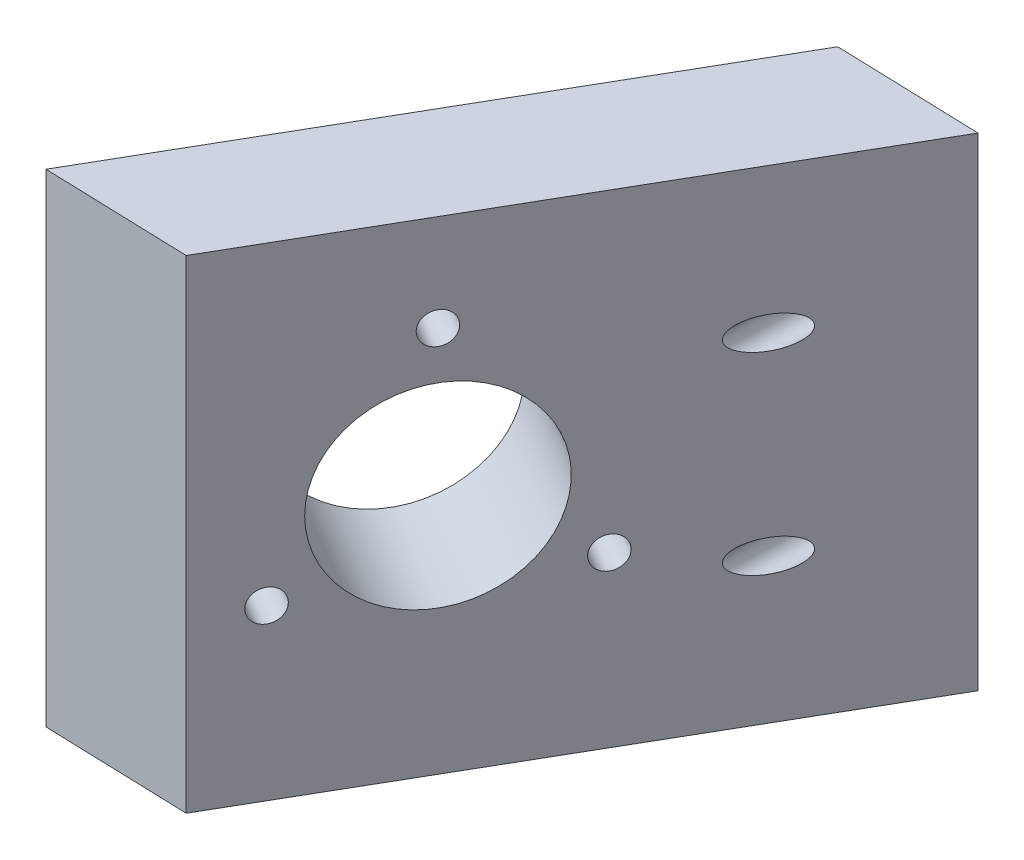
ISO-10303-21;
HEADER;
FILE_DESCRIPTION(('STEP AP214'),'2;1');
FILE_NAME('part.step','',(''),(''),'','','');
FILE_SCHEMA(('AUTOMOTIVE_DESIGN { 1 0 10303 214 1 1 1 1 }'));
ENDSEC;
DATA;
#1=APPLICATION_CONTEXT('core data for automotive mechanical design processes');
#2=APPLICATION_PROTOCOL_DEFINITION('international standard','automotive_design',2000,#1);
#3=PRODUCT_CONTEXT('',#1,'mechanical');
#4=PRODUCT('Part','Part','',(#3));
#5=PRODUCT_RELATED_PRODUCT_CATEGORY('part','',(#4));
#6=PRODUCT_DEFINITION_FORMATION('','',#4);
#7=PRODUCT_DEFINITION_CONTEXT('part definition',#1,'design');
#8=PRODUCT_DEFINITION('design','',#6,#7);
#9=PRODUCT_DEFINITION_SHAPE('','',#8);
#10=(LENGTH_UNIT() NAMED_UNIT(*) SI_UNIT(.MILLI.,.METRE.));
#11=(NAMED_UNIT(*) PLANE_ANGLE_UNIT() SI_UNIT($,.RADIAN.));
#12=(NAMED_UNIT(*) SI_UNIT($,.STERADIAN.) SOLID_ANGLE_UNIT());
#13=UNCERTAINTY_MEASURE_WITH_UNIT(LENGTH_MEASURE(1.E-05),#10,'distance_accuracy_value','');
#14=(GEOMETRIC_REPRESENTATION_CONTEXT(3) GLOBAL_UNCERTAINTY_ASSIGNED_CONTEXT((#13)) GLOBAL_UNIT_ASSIGNED_CONTEXT((#10,
#11,#12)) REPRESENTATION_CONTEXT('',''));
#15=CARTESIAN_POINT('',(0.,0.,0.));
#16=DIRECTION('',(0.,0.,1.));
#17=DIRECTION('',(1.,0.,0.));
#18=AXIS2_PLACEMENT_3D('',#15,#16,#17);
#19=CARTESIAN_POINT('',(-1.18332005275913,50.,37.2560455123764));
#20=DIRECTION('',(0.0317458177061418,0.,-0.999495974508236));
#21=DIRECTION('',(-0.999495974508236,0.,-0.0317458177061418));
#22=AXIS2_PLACEMENT_3D('',#19,#20,#21);
#23=PLANE('',#22);
#24=DIRECTION('',(0.999495974508236,0.,0.0317458177061418));
#25=VECTOR('',#24,1.);
#26=CARTESIAN_POINT('',(-1.18332005275913,0.,37.2560455123764));
#27=LINE('',#26,#25);
#28=CARTESIAN_POINT('',(-12.0885192717086,0.,36.9096764670941));
#29=VERTEX_POINT('',#28);
#30=CARTESIAN_POINT('',(2.90392034591498,0.,37.3858637326863));
#31=VERTEX_POINT('',#30);
#32=EDGE_CURVE('E137',#29,#31,#27,.T.);
#33=ORIENTED_EDGE('',*,*,#32,.T.);
#34=DIRECTION('',(0.,-1.,0.));
#35=VECTOR('',#34,1.);
#36=CARTESIAN_POINT('',(2.90392034591498,50.,37.3858637326863));
#37=LINE('',#36,#35);
#38=CARTESIAN_POINT('',(2.90392034591498,50.,37.3858637326863));
#39=VERTEX_POINT('',#38);
#40=EDGE_CURVE('E11',#39,#31,#37,.T.);
#41=ORIENTED_EDGE('',*,*,#40,.F.);
#42=DIRECTION('',(0.999495974508236,0.,0.0317458177061418));
#43=VECTOR('',#42,1.);
#44=CARTESIAN_POINT('',(-1.18332005275913,50.,37.2560455123764));
#45=LINE('',#44,#43);
#46=CARTESIAN_POINT('',(-12.0885192717086,50.,36.9096764670941));
#47=VERTEX_POINT('',#46);
#48=EDGE_CURVE('E138',#47,#39,#45,.T.);
#49=ORIENTED_EDGE('',*,*,#48,.F.);
#50=DIRECTION('',(0.,-1.,0.));
#51=VECTOR('',#50,1.);
#52=CARTESIAN_POINT('',(-12.0885192717086,50.,36.9096764670941));
#53=LINE('',#52,#51);
#54=EDGE_CURVE('E63',#47,#29,#53,.T.);
#55=ORIENTED_EDGE('',*,*,#54,.T.);
#56=EDGE_LOOP('',(#33,#41,#49,#55));
#57=FACE_BOUND('',#56,.T.);
#58=ADVANCED_FACE('F46',(#57),#23,.F.);
#59=CARTESIAN_POINT('',(18.366494126901,50.,10.603900328236));
#60=DIRECTION('',(-0.866025403784439,0.,-0.5));
#61=DIRECTION('',(-0.5,0.,0.866025403784439));
#62=AXIS2_PLACEMENT_3D('',#59,#60,#61);
#63=PLANE('',#62);
#64=CARTESIAN_POINT('',(24.9633001370909,35.,-0.822102849088624));
#65=DIRECTION('',(-0.866025403784439,0.,-0.5));
#66=DIRECTION('',(0.5,0.,-0.866025403784439));
#67=AXIS2_PLACEMENT_3D('',#64,#65,#66);
#68=ELLIPSE('',#67,3.49387289188253,1.64999999999998);
#69=CARTESIAN_POINT('',(26.7102365830322,35.,-3.84788553105269));
#70=VERTEX_POINT('',#69);
#71=EDGE_CURVE('E200',#70,#70,#68,.T.);
#72=ORIENTED_EDGE('',*,*,#71,.T.);
#73=EDGE_LOOP('',(#72));
#74=FACE_BOUND('',#73,.T.);
#75=CARTESIAN_POINT('',(24.9633001370909,15.,-0.822102849088617));
#76=DIRECTION('',(-0.866025403784439,0.,-0.5));
#77=DIRECTION('',(0.5,0.,-0.866025403784439));
#78=AXIS2_PLACEMENT_3D('',#75,#76,#77);
#79=ELLIPSE('',#78,3.49387289188253,1.64999999999999);
#80=CARTESIAN_POINT('',(26.7102365830322,15.,-3.84788553105269));
#81=VERTEX_POINT('',#80);
#82=EDGE_CURVE('E204',#81,#81,#79,.T.);
#83=ORIENTED_EDGE('',*,*,#82,.T.);
#84=EDGE_LOOP('',(#83));
#85=FACE_BOUND('',#84,.T.);
#86=CARTESIAN_POINT('',(12.44246152716,25.,20.8646257766818));
#87=DIRECTION('',(-0.866025403784439,0.,-0.5));
#88=DIRECTION('',(-0.5,0.,0.866025403784439));
#89=AXIS2_PLACEMENT_3D('',#86,#87,#88);
#90=CIRCLE('',#89,10.1);
#91=CARTESIAN_POINT('',(7.39246152716,25.,29.6114823549047));
#92=VERTEX_POINT('',#91);
#93=EDGE_CURVE('E122',#92,#92,#90,.T.);
#94=ORIENTED_EDGE('',*,*,#93,.T.);
#95=EDGE_LOOP('',(#94));
#96=FACE_BOUND('',#95,.T.);
#97=CARTESIAN_POINT('',(18.9376520555433,17.5,9.61462577668189));
#98=DIRECTION('',(0.86602540378444,0.,0.499999999999998));
#99=DIRECTION('',(0.499999999999998,0.,-0.86602540378444));
#100=AXIS2_PLACEMENT_3D('',#97,#98,#99);
#101=CIRCLE('',#100,1.64999999999999);
#102=CARTESIAN_POINT('',(19.7626520555433,17.5,8.18568386043758));
#103=VERTEX_POINT('',#102);
#104=EDGE_CURVE('E112',#103,#103,#101,.T.);
#105=ORIENTED_EDGE('',*,*,#104,.F.);
#106=EDGE_LOOP('',(#105));
#107=FACE_BOUND('',#106,.T.);
#108=CARTESIAN_POINT('',(12.44246152716,40.,20.8646257766819));
#109=DIRECTION('',(0.86602540378444,0.,0.499999999999998));
#110=DIRECTION('',(0.499999999999998,0.,-0.86602540378444));
#111=AXIS2_PLACEMENT_3D('',#108,#109,#110);
#112=CIRCLE('',#111,1.64999999999999);
#113=CARTESIAN_POINT('',(13.26746152716,40.,19.4356838604376));
#114=VERTEX_POINT('',#113);
#115=EDGE_CURVE('E111',#114,#114,#112,.T.);
#116=ORIENTED_EDGE('',*,*,#115,.F.);
#117=EDGE_LOOP('',(#116));
#118=FACE_BOUND('',#117,.T.);
#119=CARTESIAN_POINT('',(5.94727099877675,17.5,32.1146257766819));
#120=DIRECTION('',(0.86602540378444,0.,0.499999999999998));
#121=DIRECTION('',(0.499999999999998,0.,-0.86602540378444));
#122=AXIS2_PLACEMENT_3D('',#119,#120,#121);
#123=CIRCLE('',#122,1.64999999999999);
#124=CARTESIAN_POINT('',(6.77227099877674,17.5,30.6856838604376));
#125=VERTEX_POINT('',#124);
#126=EDGE_CURVE('E129',#125,#125,#123,.T.);
#127=ORIENTED_EDGE('',*,*,#126,.F.);
#128=EDGE_LOOP('',(#127));
#129=FACE_BOUND('',#128,.T.);
#130=DIRECTION('',(0.5,0.,-0.866025403784439));
#131=VECTOR('',#130,1.);
#132=CARTESIAN_POINT('',(18.366494126901,0.,10.603900328236));
#133=LINE('',#132,#131);
#134=CARTESIAN_POINT('',(32.903920345915,0.,-14.57566049438));
#135=VERTEX_POINT('',#134);
#136=EDGE_CURVE('E153',#31,#135,#133,.T.);
#137=ORIENTED_EDGE('',*,*,#136,.T.);
#138=DIRECTION('',(0.,-1.,0.));
#139=VECTOR('',#138,1.);
#140=CARTESIAN_POINT('',(32.903920345915,50.,-14.57566049438));
#141=LINE('',#140,#139);
#142=CARTESIAN_POINT('',(32.903920345915,50.,-14.57566049438));
#143=VERTEX_POINT('',#142);
#144=EDGE_CURVE('E55',#143,#135,#141,.T.);
#145=ORIENTED_EDGE('',*,*,#144,.F.);
#146=DIRECTION('',(0.5,0.,-0.866025403784439));
#147=VECTOR('',#146,1.);
#148=CARTESIAN_POINT('',(18.366494126901,50.,10.603900328236));
#149=LINE('',#148,#147);
#150=EDGE_CURVE('E89',#39,#143,#149,.T.);
#151=ORIENTED_EDGE('',*,*,#150,.F.);
#152=ORIENTED_EDGE('',*,*,#40,.T.);
#153=EDGE_LOOP('',(#137,#145,#151,#152));
#154=FACE_BOUND('',#153,.T.);
#155=ADVANCED_FACE('F170',(#74,#85,#96,#107,#118,#129,#154),#63,.F.);
#156=CARTESIAN_POINT('',(0.495643510509169,50.,-15.6050065596239));
#157=DIRECTION('',(0.0317458177061467,0.,-0.999495974508236));
#158=DIRECTION('',(-0.999495974508236,0.,-0.0317458177061467));
#159=AXIS2_PLACEMENT_3D('',#156,#157,#158);
#160=PLANE('',#159);
#161=CARTESIAN_POINT('',(25.4077005371032,35.,-14.8137541271763));
#162=DIRECTION('',(0.0317458177061419,0.,-0.999495974508236));
#163=DIRECTION('',(-0.999495974508236,0.,-0.0317458177061419));
#164=AXIS2_PLACEMENT_3D('',#161,#162,#163);
#165=CIRCLE('',#164,1.64999999999998);
#166=CARTESIAN_POINT('',(23.7585321791646,35.,-14.8661347263914));
#167=VERTEX_POINT('',#166);
#168=EDGE_CURVE('E363',#167,#167,#165,.T.);
#169=ORIENTED_EDGE('',*,*,#168,.F.);
#170=EDGE_LOOP('',(#169));
#171=FACE_BOUND('',#170,.T.);
#172=CARTESIAN_POINT('',(25.4077005371032,15.,-14.8137541271763));
#173=DIRECTION('',(0.0317458177061419,0.,-0.999495974508236));
#174=DIRECTION('',(-0.999495974508236,0.,-0.0317458177061419));
#175=AXIS2_PLACEMENT_3D('',#172,#173,#174);
#176=CIRCLE('',#175,1.64999999999999);
#177=CARTESIAN_POINT('',(23.7585321791646,15.,-14.8661347263914));
#178=VERTEX_POINT('',#177);
#179=EDGE_CURVE('E365',#178,#178,#176,.T.);
#180=ORIENTED_EDGE('',*,*,#179,.F.);
#181=EDGE_LOOP('',(#180));
#182=FACE_BOUND('',#181,.T.);
#183=DIRECTION('',(0.999495974508236,0.,0.0317458177061467));
#184=VECTOR('',#183,1.);
#185=CARTESIAN_POINT('',(0.495643510509169,0.,-15.6050065596239));
#186=LINE('',#185,#184);
#187=CARTESIAN_POINT('',(17.9114807282913,0.,-15.0518477599723));
#188=VERTEX_POINT('',#187);
#189=EDGE_CURVE('E157',#188,#135,#186,.T.);
#190=ORIENTED_EDGE('',*,*,#189,.F.);
#191=DIRECTION('',(0.,-1.,0.));
#192=VECTOR('',#191,1.);
#193=CARTESIAN_POINT('',(17.9114807282913,50.,-15.0518477599723));
#194=LINE('',#193,#192);
#195=CARTESIAN_POINT('',(17.9114807282913,50.,-15.0518477599723));
#196=VERTEX_POINT('',#195);
#197=EDGE_CURVE('E78',#196,#188,#194,.T.);
#198=ORIENTED_EDGE('',*,*,#197,.F.);
#199=DIRECTION('',(0.999495974508236,0.,0.0317458177061467));
#200=VECTOR('',#199,1.);
#201=CARTESIAN_POINT('',(0.495643510509169,50.,-15.6050065596239));
#202=LINE('',#201,#200);
#203=EDGE_CURVE('E144',#196,#143,#202,.T.);
#204=ORIENTED_EDGE('',*,*,#203,.T.);
#205=ORIENTED_EDGE('',*,*,#144,.T.);
#206=EDGE_LOOP('',(#190,#198,#204,#205));
#207=FACE_BOUND('',#206,.T.);
#208=ADVANCED_FACE('F168',(#171,#182,#207),#160,.T.);
#209=CARTESIAN_POINT('',(6.9159692792026,50.,3.99293672505478));
#210=DIRECTION('',(-0.86602540378444,0.,-0.499999999999998));
#211=DIRECTION('',(-0.499999999999998,0.,0.86602540378444));
#212=AXIS2_PLACEMENT_3D('',#209,#210,#211);
#213=PLANE('',#212);
#214=CARTESIAN_POINT('',(0.991936679461555,25.,14.2536621735007));
#215=DIRECTION('',(-0.86602540378444,0.,-0.499999999999998));
#216=DIRECTION('',(-0.499999999999998,0.,0.86602540378444));
#217=AXIS2_PLACEMENT_3D('',#214,#215,#216);
#218=CIRCLE('',#217,10.1);
#219=CARTESIAN_POINT('',(-4.05806332053842,25.,23.0005187517235));
#220=VERTEX_POINT('',#219);
#221=EDGE_CURVE('E374',#220,#220,#218,.T.);
#222=ORIENTED_EDGE('',*,*,#221,.F.);
#223=EDGE_LOOP('',(#222));
#224=FACE_BOUND('',#223,.T.);
#225=DIRECTION('',(0.499999999999998,0.,-0.86602540378444));
#226=VECTOR('',#225,1.);
#227=CARTESIAN_POINT('',(6.9159692792026,0.,3.99293672505478));
#228=LINE('',#227,#226);
#229=EDGE_CURVE('E141',#29,#188,#228,.T.);
#230=ORIENTED_EDGE('',*,*,#229,.F.);
#231=ORIENTED_EDGE('',*,*,#54,.F.);
#232=DIRECTION('',(0.499999999999998,0.,-0.86602540378444));
#233=VECTOR('',#232,1.);
#234=CARTESIAN_POINT('',(6.9159692792026,50.,3.99293672505478));
#235=LINE('',#234,#233);
#236=EDGE_CURVE('E148',#47,#196,#235,.T.);
#237=ORIENTED_EDGE('',*,*,#236,.T.);
#238=ORIENTED_EDGE('',*,*,#197,.T.);
#239=EDGE_LOOP('',(#230,#231,#237,#238));
#240=FACE_BOUND('',#239,.T.);
#241=ADVANCED_FACE('F174',(#224,#240),#213,.T.);
#242=CARTESIAN_POINT('',(0.,50.,0.));
#243=DIRECTION('',(0.,1.,0.));
#244=DIRECTION('',(0.,0.,1.));
#245=AXIS2_PLACEMENT_3D('',#242,#243,#244);
#246=PLANE('',#245);
#247=ORIENTED_EDGE('',*,*,#48,.T.);
#248=ORIENTED_EDGE('',*,*,#150,.T.);
#249=ORIENTED_EDGE('',*,*,#203,.F.);
#250=ORIENTED_EDGE('',*,*,#236,.F.);
#251=EDGE_LOOP('',(#247,#248,#249,#250));
#252=FACE_BOUND('',#251,.T.);
#253=ADVANCED_FACE('F176',(#252),#246,.T.);
#254=CARTESIAN_POINT('',(0.,0.,0.));
#255=DIRECTION('',(0.,1.,0.));
#256=DIRECTION('',(0.,0.,1.));
#257=AXIS2_PLACEMENT_3D('',#254,#255,#256);
#258=PLANE('',#257);
#259=ORIENTED_EDGE('',*,*,#32,.F.);
#260=ORIENTED_EDGE('',*,*,#229,.T.);
#261=ORIENTED_EDGE('',*,*,#189,.T.);
#262=ORIENTED_EDGE('',*,*,#136,.F.);
#263=EDGE_LOOP('',(#259,#260,#261,#262));
#264=FACE_BOUND('',#263,.T.);
#265=ADVANCED_FACE('F173',(#264),#258,.F.);
#266=CARTESIAN_POINT('',(-2.79958557944609,17.5,27.0646257766819));
#267=DIRECTION('',(0.86602540378444,0.,0.499999999999998));
#268=DIRECTION('',(0.499999999999998,0.,-0.86602540378444));
#269=AXIS2_PLACEMENT_3D('',#266,#267,#268);
#270=CONICAL_SURFACE('',#269,1.64999999999999,1.02974425867665);
#271=CARTESIAN_POINT('',(-3.65818050379509,17.5,26.5689157659842));
#272=VERTEX_POINT('',#271);
#273=VERTEX_LOOP('',#272);
#274=FACE_BOUND('',#273,.T.);
#275=CARTESIAN_POINT('',(-2.79958557944609,17.5,27.0646257766819));
#276=DIRECTION('',(0.86602540378444,0.,0.499999999999998));
#277=DIRECTION('',(0.499999999999998,0.,-0.86602540378444));
#278=AXIS2_PLACEMENT_3D('',#275,#276,#277);
#279=CIRCLE('',#278,1.64999999999999);
#280=CARTESIAN_POINT('',(-1.9745855794461,17.5,25.6356838604376));
#281=VERTEX_POINT('',#280);
#282=EDGE_CURVE('E133',#281,#281,#279,.T.);
#283=ORIENTED_EDGE('',*,*,#282,.T.);
#284=EDGE_LOOP('',(#283));
#285=FACE_BOUND('',#284,.T.);
#286=ADVANCED_FACE('F217',(#274,#285),#270,.F.);
#287=CARTESIAN_POINT('',(5.94727099877675,17.5,32.1146257766819));
#288=DIRECTION('',(0.86602540378444,0.,0.499999999999998));
#289=DIRECTION('',(0.499999999999998,0.,-0.86602540378444));
#290=AXIS2_PLACEMENT_3D('',#287,#288,#289);
#291=CYLINDRICAL_SURFACE('',#290,1.64999999999999);
#292=ORIENTED_EDGE('',*,*,#282,.F.);
#293=EDGE_LOOP('',(#292));
#294=FACE_BOUND('',#293,.T.);
#295=ORIENTED_EDGE('',*,*,#126,.T.);
#296=EDGE_LOOP('',(#295));
#297=FACE_BOUND('',#296,.T.);
#298=ADVANCED_FACE('F214',(#294,#297),#291,.F.);
#299=CARTESIAN_POINT('',(3.69560494893716,40.,15.8146257766819));
#300=DIRECTION('',(0.86602540378444,0.,0.499999999999998));
#301=DIRECTION('',(0.499999999999998,0.,-0.86602540378444));
#302=AXIS2_PLACEMENT_3D('',#299,#300,#301);
#303=CONICAL_SURFACE('',#302,1.64999999999998,1.02974425867665);
#304=CARTESIAN_POINT('',(2.83701002458817,40.,15.3189157659842));
#305=VERTEX_POINT('',#304);
#306=VERTEX_LOOP('',#305);
#307=FACE_BOUND('',#306,.T.);
#308=CARTESIAN_POINT('',(3.69560494893716,40.,15.8146257766819));
#309=DIRECTION('',(0.86602540378444,0.,0.499999999999998));
#310=DIRECTION('',(0.499999999999998,0.,-0.86602540378444));
#311=AXIS2_PLACEMENT_3D('',#308,#309,#310);
#312=CIRCLE('',#311,1.64999999999998);
#313=CARTESIAN_POINT('',(4.52060494893715,40.,14.3856838604376));
#314=VERTEX_POINT('',#313);
#315=EDGE_CURVE('E118',#314,#314,#312,.T.);
#316=ORIENTED_EDGE('',*,*,#315,.T.);
#317=EDGE_LOOP('',(#316));
#318=FACE_BOUND('',#317,.T.);
#319=ADVANCED_FACE('F216',(#307,#318),#303,.F.);
#320=CARTESIAN_POINT('',(12.44246152716,40.,20.8646257766819));
#321=DIRECTION('',(0.86602540378444,0.,0.499999999999998));
#322=DIRECTION('',(0.499999999999998,0.,-0.86602540378444));
#323=AXIS2_PLACEMENT_3D('',#320,#321,#322);
#324=CYLINDRICAL_SURFACE('',#323,1.64999999999999);
#325=ORIENTED_EDGE('',*,*,#315,.F.);
#326=EDGE_LOOP('',(#325));
#327=FACE_BOUND('',#326,.T.);
#328=ORIENTED_EDGE('',*,*,#115,.T.);
#329=EDGE_LOOP('',(#328));
#330=FACE_BOUND('',#329,.T.);
#331=ADVANCED_FACE('F104',(#327,#330),#324,.F.);
#332=CARTESIAN_POINT('',(10.1907954773204,17.5,4.56462577668192));
#333=DIRECTION('',(0.86602540378444,0.,0.499999999999998));
#334=DIRECTION('',(0.499999999999998,0.,-0.86602540378444));
#335=AXIS2_PLACEMENT_3D('',#332,#333,#334);
#336=CONICAL_SURFACE('',#335,1.64999999999999,1.02974425867665);
#337=CARTESIAN_POINT('',(9.33220055297143,17.5,4.06891576598418));
#338=VERTEX_POINT('',#337);
#339=VERTEX_LOOP('',#338);
#340=FACE_BOUND('',#339,.T.);
#341=CARTESIAN_POINT('',(10.1907954773204,17.5,4.56462577668192));
#342=DIRECTION('',(0.86602540378444,0.,0.499999999999998));
#343=DIRECTION('',(0.499999999999998,0.,-0.86602540378444));
#344=AXIS2_PLACEMENT_3D('',#341,#342,#343);
#345=CIRCLE('',#344,1.64999999999999);
#346=CARTESIAN_POINT('',(11.0157954773204,17.5,3.1356838604376));
#347=VERTEX_POINT('',#346);
#348=EDGE_CURVE('E108',#347,#347,#345,.T.);
#349=ORIENTED_EDGE('',*,*,#348,.T.);
#350=EDGE_LOOP('',(#349));
#351=FACE_BOUND('',#350,.T.);
#352=ADVANCED_FACE('F100',(#340,#351),#336,.F.);
#353=CARTESIAN_POINT('',(18.9376520555433,17.5,9.61462577668189));
#354=DIRECTION('',(0.86602540378444,0.,0.499999999999998));
#355=DIRECTION('',(0.499999999999998,0.,-0.86602540378444));
#356=AXIS2_PLACEMENT_3D('',#353,#354,#355);
#357=CYLINDRICAL_SURFACE('',#356,1.64999999999999);
#358=ORIENTED_EDGE('',*,*,#348,.F.);
#359=EDGE_LOOP('',(#358));
#360=FACE_BOUND('',#359,.T.);
#361=ORIENTED_EDGE('',*,*,#104,.T.);
#362=EDGE_LOOP('',(#361));
#363=FACE_BOUND('',#362,.T.);
#364=ADVANCED_FACE('F103',(#360,#363),#357,.F.);
#365=CARTESIAN_POINT('',(44.2932068686836,25.,39.2536621735006));
#366=DIRECTION('',(-0.86602540378444,0.,-0.499999999999998));
#367=DIRECTION('',(-0.499999999999998,0.,0.86602540378444));
#368=AXIS2_PLACEMENT_3D('',#365,#366,#367);
#369=CYLINDRICAL_SURFACE('',#368,10.1);
#370=ORIENTED_EDGE('',*,*,#221,.T.);
#371=EDGE_LOOP('',(#370));
#372=FACE_BOUND('',#371,.T.);
#373=ORIENTED_EDGE('',*,*,#93,.F.);
#374=EDGE_LOOP('',(#373));
#375=FACE_BOUND('',#374,.T.);
#376=ADVANCED_FACE('F268',(#372,#375),#369,.F.);
#377=CARTESIAN_POINT('',(25.4077005371032,15.,-14.8137541271763));
#378=DIRECTION('',(0.0317458177061419,0.,-0.999495974508236));
#379=DIRECTION('',(-0.999495974508236,0.,-0.0317458177061419));
#380=AXIS2_PLACEMENT_3D('',#377,#378,#379);
#381=CYLINDRICAL_SURFACE('',#380,1.64999999999999);
#382=ORIENTED_EDGE('',*,*,#179,.T.);
#383=EDGE_LOOP('',(#382));
#384=FACE_BOUND('',#383,.T.);
#385=ORIENTED_EDGE('',*,*,#82,.F.);
#386=EDGE_LOOP('',(#385));
#387=FACE_BOUND('',#386,.T.);
#388=ADVANCED_FACE('F276',(#384,#387),#381,.F.);
#389=CARTESIAN_POINT('',(25.4077005371032,35.,-14.8137541271763));
#390=DIRECTION('',(0.0317458177061419,0.,-0.999495974508236));
#391=DIRECTION('',(-0.999495974508236,0.,-0.0317458177061419));
#392=AXIS2_PLACEMENT_3D('',#389,#390,#391);
#393=CYLINDRICAL_SURFACE('',#392,1.64999999999998);
#394=ORIENTED_EDGE('',*,*,#168,.T.);
#395=EDGE_LOOP('',(#394));
#396=FACE_BOUND('',#395,.T.);
#397=ORIENTED_EDGE('',*,*,#71,.F.);
#398=EDGE_LOOP('',(#397));
#399=FACE_BOUND('',#398,.T.);
#400=ADVANCED_FACE('F287',(#396,#399),#393,.F.);
#401=CLOSED_SHELL('',(#58,#155,#208,#241,#253,#265,#286,#298,#319,#331,#352,#364,#376,#388,#400));
#402=MANIFOLD_SOLID_BREP('B2',#401);
#403=ADVANCED_BREP_SHAPE_REPRESENTATION('',(#18,#402),#14);
#404=SHAPE_DEFINITION_REPRESENTATION(#9,#403);
ENDSEC;
END-ISO-10303-21;
